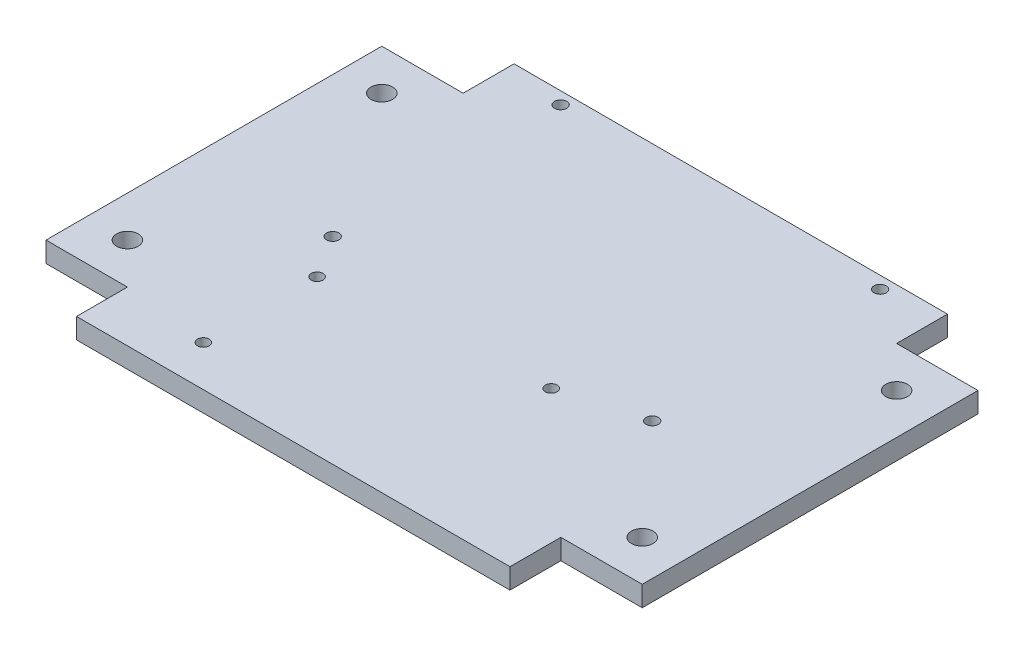
ISO-10303-21;
HEADER;
FILE_DESCRIPTION(('STEP AP214'),'2;1');
FILE_NAME('part.step','',(''),(''),'','','');
FILE_SCHEMA(('AUTOMOTIVE_DESIGN { 1 0 10303 214 1 1 1 1 }'));
ENDSEC;
DATA;
#1=APPLICATION_CONTEXT('core data for automotive mechanical design processes');
#2=APPLICATION_PROTOCOL_DEFINITION('international standard','automotive_design',2000,#1);
#3=PRODUCT_CONTEXT('',#1,'mechanical');
#4=PRODUCT('Part','Part','',(#3));
#5=PRODUCT_RELATED_PRODUCT_CATEGORY('part','',(#4));
#6=PRODUCT_DEFINITION_FORMATION('','',#4);
#7=PRODUCT_DEFINITION_CONTEXT('part definition',#1,'design');
#8=PRODUCT_DEFINITION('design','',#6,#7);
#9=PRODUCT_DEFINITION_SHAPE('','',#8);
#10=(LENGTH_UNIT() NAMED_UNIT(*) SI_UNIT(.MILLI.,.METRE.));
#11=(NAMED_UNIT(*) PLANE_ANGLE_UNIT() SI_UNIT($,.RADIAN.));
#12=(NAMED_UNIT(*) SI_UNIT($,.STERADIAN.) SOLID_ANGLE_UNIT());
#13=UNCERTAINTY_MEASURE_WITH_UNIT(LENGTH_MEASURE(1.E-05),#10,'distance_accuracy_value','');
#14=(GEOMETRIC_REPRESENTATION_CONTEXT(3) GLOBAL_UNCERTAINTY_ASSIGNED_CONTEXT((#13)) GLOBAL_UNIT_ASSIGNED_CONTEXT((#10,
#11,#12)) REPRESENTATION_CONTEXT('',''));
#15=CARTESIAN_POINT('',(0.,0.,0.));
#16=DIRECTION('',(0.,0.,1.));
#17=DIRECTION('',(1.,0.,0.));
#18=AXIS2_PLACEMENT_3D('',#15,#16,#17);
#19=CARTESIAN_POINT('',(53.25,5.,50.));
#20=DIRECTION('',(0.,0.,-1.));
#21=DIRECTION('',(-1.,0.,0.));
#22=AXIS2_PLACEMENT_3D('',#19,#20,#21);
#23=PLANE('',#22);
#24=DIRECTION('',(1.,0.,0.));
#25=VECTOR('',#24,1.);
#26=CARTESIAN_POINT('',(53.25,0.,50.));
#27=LINE('',#26,#25);
#28=CARTESIAN_POINT('',(-53.25,0.,50.));
#29=VERTEX_POINT('',#28);
#30=CARTESIAN_POINT('',(53.25,0.,50.));
#31=VERTEX_POINT('',#30);
#32=EDGE_CURVE('E159',#29,#31,#27,.T.);
#33=ORIENTED_EDGE('',*,*,#32,.T.);
#34=DIRECTION('',(0.,-1.,0.));
#35=VECTOR('',#34,1.);
#36=CARTESIAN_POINT('',(53.25,5.,50.));
#37=LINE('',#36,#35);
#38=CARTESIAN_POINT('',(53.25,5.,50.));
#39=VERTEX_POINT('',#38);
#40=EDGE_CURVE('E11',#39,#31,#37,.T.);
#41=ORIENTED_EDGE('',*,*,#40,.F.);
#42=DIRECTION('',(1.,0.,0.));
#43=VECTOR('',#42,1.);
#44=CARTESIAN_POINT('',(53.25,5.,50.));
#45=LINE('',#44,#43);
#46=CARTESIAN_POINT('',(-53.25,5.,50.));
#47=VERTEX_POINT('',#46);
#48=EDGE_CURVE('E182',#47,#39,#45,.T.);
#49=ORIENTED_EDGE('',*,*,#48,.F.);
#50=DIRECTION('',(0.,-1.,0.));
#51=VECTOR('',#50,1.);
#52=CARTESIAN_POINT('',(-53.25,5.,50.));
#53=LINE('',#52,#51);
#54=EDGE_CURVE('E155',#47,#29,#53,.T.);
#55=ORIENTED_EDGE('',*,*,#54,.T.);
#56=EDGE_LOOP('',(#33,#41,#49,#55));
#57=FACE_BOUND('',#56,.T.);
#58=ADVANCED_FACE('F37',(#57),#23,.F.);
#59=CARTESIAN_POINT('',(53.25,5.,50.));
#60=DIRECTION('',(-1.,0.,0.));
#61=DIRECTION('',(0.,0.,1.));
#62=AXIS2_PLACEMENT_3D('',#59,#60,#61);
#63=PLANE('',#62);
#64=DIRECTION('',(0.,0.,-1.));
#65=VECTOR('',#64,1.);
#66=CARTESIAN_POINT('',(53.25,0.,50.));
#67=LINE('',#66,#65);
#68=CARTESIAN_POINT('',(53.25,0.,37.5));
#69=VERTEX_POINT('',#68);
#70=EDGE_CURVE('E162',#31,#69,#67,.T.);
#71=ORIENTED_EDGE('',*,*,#70,.T.);
#72=DIRECTION('',(0.,-1.,0.));
#73=VECTOR('',#72,1.);
#74=CARTESIAN_POINT('',(53.25,5.,37.5));
#75=LINE('',#74,#73);
#76=CARTESIAN_POINT('',(53.25,5.,37.5));
#77=VERTEX_POINT('',#76);
#78=EDGE_CURVE('E46',#77,#69,#75,.T.);
#79=ORIENTED_EDGE('',*,*,#78,.F.);
#80=DIRECTION('',(0.,0.,-1.));
#81=VECTOR('',#80,1.);
#82=CARTESIAN_POINT('',(53.25,5.,50.));
#83=LINE('',#82,#81);
#84=EDGE_CURVE('E110',#39,#77,#83,.T.);
#85=ORIENTED_EDGE('',*,*,#84,.F.);
#86=ORIENTED_EDGE('',*,*,#40,.T.);
#87=EDGE_LOOP('',(#71,#79,#85,#86));
#88=FACE_BOUND('',#87,.T.);
#89=ADVANCED_FACE('F298',(#88),#63,.F.);
#90=CARTESIAN_POINT('',(53.25,5.,37.5));
#91=DIRECTION('',(0.,0.,-1.));
#92=DIRECTION('',(-1.,0.,0.));
#93=AXIS2_PLACEMENT_3D('',#90,#91,#92);
#94=PLANE('',#93);
#95=DIRECTION('',(1.,0.,0.));
#96=VECTOR('',#95,1.);
#97=CARTESIAN_POINT('',(53.25,0.,37.5));
#98=LINE('',#97,#96);
#99=CARTESIAN_POINT('',(73.25,0.,37.5));
#100=VERTEX_POINT('',#99);
#101=EDGE_CURVE('E165',#69,#100,#98,.T.);
#102=ORIENTED_EDGE('',*,*,#101,.T.);
#103=DIRECTION('',(0.,-1.,0.));
#104=VECTOR('',#103,1.);
#105=CARTESIAN_POINT('',(73.25,5.,37.5));
#106=LINE('',#105,#104);
#107=CARTESIAN_POINT('',(73.25,5.,37.5));
#108=VERTEX_POINT('',#107);
#109=EDGE_CURVE('E201',#108,#100,#106,.T.);
#110=ORIENTED_EDGE('',*,*,#109,.F.);
#111=DIRECTION('',(1.,0.,0.));
#112=VECTOR('',#111,1.);
#113=CARTESIAN_POINT('',(53.25,5.,37.5));
#114=LINE('',#113,#112);
#115=EDGE_CURVE('E257',#77,#108,#114,.T.);
#116=ORIENTED_EDGE('',*,*,#115,.F.);
#117=ORIENTED_EDGE('',*,*,#78,.T.);
#118=EDGE_LOOP('',(#102,#110,#116,#117));
#119=FACE_BOUND('',#118,.T.);
#120=ADVANCED_FACE('F302',(#119),#94,.F.);
#121=CARTESIAN_POINT('',(73.2499999999997,5.,-45.));
#122=DIRECTION('',(-1.,0.,0.));
#123=DIRECTION('',(0.,0.,1.));
#124=AXIS2_PLACEMENT_3D('',#121,#122,#123);
#125=PLANE('',#124);
#126=DIRECTION('',(0.,0.,-1.));
#127=VECTOR('',#126,1.);
#128=CARTESIAN_POINT('',(73.2499999999997,0.,-45.));
#129=LINE('',#128,#127);
#130=CARTESIAN_POINT('',(73.2499999999997,0.,-45.));
#131=VERTEX_POINT('',#130);
#132=EDGE_CURVE('E167',#100,#131,#129,.T.);
#133=ORIENTED_EDGE('',*,*,#132,.T.);
#134=DIRECTION('',(0.,-1.,0.));
#135=VECTOR('',#134,1.);
#136=CARTESIAN_POINT('',(73.2499999999997,5.,-45.));
#137=LINE('',#136,#135);
#138=CARTESIAN_POINT('',(73.2499999999997,5.,-45.));
#139=VERTEX_POINT('',#138);
#140=EDGE_CURVE('E198',#139,#131,#137,.T.);
#141=ORIENTED_EDGE('',*,*,#140,.F.);
#142=DIRECTION('',(0.,0.,-1.));
#143=VECTOR('',#142,1.);
#144=CARTESIAN_POINT('',(73.2499999999997,5.,-45.));
#145=LINE('',#144,#143);
#146=EDGE_CURVE('E259',#108,#139,#145,.T.);
#147=ORIENTED_EDGE('',*,*,#146,.F.);
#148=ORIENTED_EDGE('',*,*,#109,.T.);
#149=EDGE_LOOP('',(#133,#141,#147,#148));
#150=FACE_BOUND('',#149,.T.);
#151=ADVANCED_FACE('F306',(#150),#125,.F.);
#152=CARTESIAN_POINT('',(53.25,5.,-45.));
#153=DIRECTION('',(0.,0.,1.));
#154=DIRECTION('',(1.,0.,0.));
#155=AXIS2_PLACEMENT_3D('',#152,#153,#154);
#156=PLANE('',#155);
#157=DIRECTION('',(-1.,0.,0.));
#158=VECTOR('',#157,1.);
#159=CARTESIAN_POINT('',(53.25,0.,-45.));
#160=LINE('',#159,#158);
#161=CARTESIAN_POINT('',(53.25,0.,-45.));
#162=VERTEX_POINT('',#161);
#163=EDGE_CURVE('E169',#131,#162,#160,.T.);
#164=ORIENTED_EDGE('',*,*,#163,.T.);
#165=DIRECTION('',(0.,-1.,0.));
#166=VECTOR('',#165,1.);
#167=CARTESIAN_POINT('',(53.25,5.,-45.));
#168=LINE('',#167,#166);
#169=CARTESIAN_POINT('',(53.25,5.,-45.));
#170=VERTEX_POINT('',#169);
#171=EDGE_CURVE('E195',#170,#162,#168,.T.);
#172=ORIENTED_EDGE('',*,*,#171,.F.);
#173=DIRECTION('',(-1.,0.,0.));
#174=VECTOR('',#173,1.);
#175=CARTESIAN_POINT('',(53.25,5.,-45.));
#176=LINE('',#175,#174);
#177=EDGE_CURVE('E261',#139,#170,#176,.T.);
#178=ORIENTED_EDGE('',*,*,#177,.F.);
#179=ORIENTED_EDGE('',*,*,#140,.T.);
#180=EDGE_LOOP('',(#164,#172,#178,#179));
#181=FACE_BOUND('',#180,.T.);
#182=ADVANCED_FACE('F312',(#181),#156,.F.);
#183=CARTESIAN_POINT('',(53.25,5.,-45.));
#184=DIRECTION('',(-1.,0.,0.));
#185=DIRECTION('',(0.,0.,1.));
#186=AXIS2_PLACEMENT_3D('',#183,#184,#185);
#187=PLANE('',#186);
#188=DIRECTION('',(0.,0.,-1.));
#189=VECTOR('',#188,1.);
#190=CARTESIAN_POINT('',(53.25,0.,-45.));
#191=LINE('',#190,#189);
#192=CARTESIAN_POINT('',(53.2499999999997,0.,-57.5));
#193=VERTEX_POINT('',#192);
#194=EDGE_CURVE('E171',#162,#193,#191,.T.);
#195=ORIENTED_EDGE('',*,*,#194,.T.);
#196=DIRECTION('',(0.,-1.,0.));
#197=VECTOR('',#196,1.);
#198=CARTESIAN_POINT('',(53.2499999999997,5.,-57.5));
#199=LINE('',#198,#197);
#200=CARTESIAN_POINT('',(53.2499999999997,5.,-57.5));
#201=VERTEX_POINT('',#200);
#202=EDGE_CURVE('E192',#201,#193,#199,.T.);
#203=ORIENTED_EDGE('',*,*,#202,.F.);
#204=DIRECTION('',(0.,0.,-1.));
#205=VECTOR('',#204,1.);
#206=CARTESIAN_POINT('',(53.25,5.,-45.));
#207=LINE('',#206,#205);
#208=EDGE_CURVE('E263',#170,#201,#207,.T.);
#209=ORIENTED_EDGE('',*,*,#208,.F.);
#210=ORIENTED_EDGE('',*,*,#171,.T.);
#211=EDGE_LOOP('',(#195,#203,#209,#210));
#212=FACE_BOUND('',#211,.T.);
#213=ADVANCED_FACE('F316',(#212),#187,.F.);
#214=CARTESIAN_POINT('',(-53.2500000000003,5.,-57.5));
#215=DIRECTION('',(0.,0.,1.));
#216=DIRECTION('',(1.,0.,0.));
#217=AXIS2_PLACEMENT_3D('',#214,#215,#216);
#218=PLANE('',#217);
#219=DIRECTION('',(-1.,0.,0.));
#220=VECTOR('',#219,1.);
#221=CARTESIAN_POINT('',(-53.2500000000003,0.,-57.5));
#222=LINE('',#221,#220);
#223=CARTESIAN_POINT('',(-53.2500000000003,0.,-57.5));
#224=VERTEX_POINT('',#223);
#225=EDGE_CURVE('E173',#193,#224,#222,.T.);
#226=ORIENTED_EDGE('',*,*,#225,.T.);
#227=DIRECTION('',(0.,-1.,0.));
#228=VECTOR('',#227,1.);
#229=CARTESIAN_POINT('',(-53.2500000000003,5.,-57.5));
#230=LINE('',#229,#228);
#231=CARTESIAN_POINT('',(-53.2500000000003,5.,-57.5));
#232=VERTEX_POINT('',#231);
#233=EDGE_CURVE('E189',#232,#224,#230,.T.);
#234=ORIENTED_EDGE('',*,*,#233,.F.);
#235=DIRECTION('',(-1.,0.,0.));
#236=VECTOR('',#235,1.);
#237=CARTESIAN_POINT('',(-53.2500000000003,5.,-57.5));
#238=LINE('',#237,#236);
#239=EDGE_CURVE('E265',#201,#232,#238,.T.);
#240=ORIENTED_EDGE('',*,*,#239,.F.);
#241=ORIENTED_EDGE('',*,*,#202,.T.);
#242=EDGE_LOOP('',(#226,#234,#240,#241));
#243=FACE_BOUND('',#242,.T.);
#244=ADVANCED_FACE('F320',(#243),#218,.F.);
#245=CARTESIAN_POINT('',(-53.2500000000003,5.,-45.));
#246=DIRECTION('',(1.,0.,0.));
#247=DIRECTION('',(0.,0.,-1.));
#248=AXIS2_PLACEMENT_3D('',#245,#246,#247);
#249=PLANE('',#248);
#250=DIRECTION('',(0.,0.,1.));
#251=VECTOR('',#250,1.);
#252=CARTESIAN_POINT('',(-53.2500000000003,0.,-45.));
#253=LINE('',#252,#251);
#254=CARTESIAN_POINT('',(-53.2500000000003,0.,-45.));
#255=VERTEX_POINT('',#254);
#256=EDGE_CURVE('E175',#224,#255,#253,.T.);
#257=ORIENTED_EDGE('',*,*,#256,.T.);
#258=DIRECTION('',(0.,-1.,0.));
#259=VECTOR('',#258,1.);
#260=CARTESIAN_POINT('',(-53.2500000000003,5.,-45.));
#261=LINE('',#260,#259);
#262=CARTESIAN_POINT('',(-53.2500000000003,5.,-45.));
#263=VERTEX_POINT('',#262);
#264=EDGE_CURVE('E186',#263,#255,#261,.T.);
#265=ORIENTED_EDGE('',*,*,#264,.F.);
#266=DIRECTION('',(0.,0.,1.));
#267=VECTOR('',#266,1.);
#268=CARTESIAN_POINT('',(-53.2500000000003,5.,-45.));
#269=LINE('',#268,#267);
#270=EDGE_CURVE('E267',#232,#263,#269,.T.);
#271=ORIENTED_EDGE('',*,*,#270,.F.);
#272=ORIENTED_EDGE('',*,*,#233,.T.);
#273=EDGE_LOOP('',(#257,#265,#271,#272));
#274=FACE_BOUND('',#273,.T.);
#275=ADVANCED_FACE('F273',(#274),#249,.F.);
#276=CARTESIAN_POINT('',(-73.25,5.,-45.));
#277=DIRECTION('',(0.,0.,1.));
#278=DIRECTION('',(1.,0.,0.));
#279=AXIS2_PLACEMENT_3D('',#276,#277,#278);
#280=PLANE('',#279);
#281=DIRECTION('',(-1.,0.,0.));
#282=VECTOR('',#281,1.);
#283=CARTESIAN_POINT('',(-73.25,0.,-45.));
#284=LINE('',#283,#282);
#285=CARTESIAN_POINT('',(-73.25,0.,-45.));
#286=VERTEX_POINT('',#285);
#287=EDGE_CURVE('E177',#255,#286,#284,.T.);
#288=ORIENTED_EDGE('',*,*,#287,.T.);
#289=DIRECTION('',(0.,-1.,0.));
#290=VECTOR('',#289,1.);
#291=CARTESIAN_POINT('',(-73.25,5.,-45.));
#292=LINE('',#291,#290);
#293=CARTESIAN_POINT('',(-73.25,5.,-45.));
#294=VERTEX_POINT('',#293);
#295=EDGE_CURVE('E150',#294,#286,#292,.T.);
#296=ORIENTED_EDGE('',*,*,#295,.F.);
#297=DIRECTION('',(-1.,0.,0.));
#298=VECTOR('',#297,1.);
#299=CARTESIAN_POINT('',(-73.25,5.,-45.));
#300=LINE('',#299,#298);
#301=EDGE_CURVE('E141',#263,#294,#300,.T.);
#302=ORIENTED_EDGE('',*,*,#301,.F.);
#303=ORIENTED_EDGE('',*,*,#264,.T.);
#304=EDGE_LOOP('',(#288,#296,#302,#303));
#305=FACE_BOUND('',#304,.T.);
#306=ADVANCED_FACE('F277',(#305),#280,.F.);
#307=CARTESIAN_POINT('',(-73.25,5.,37.5));
#308=DIRECTION('',(1.,0.,0.));
#309=DIRECTION('',(0.,0.,-1.));
#310=AXIS2_PLACEMENT_3D('',#307,#308,#309);
#311=PLANE('',#310);
#312=DIRECTION('',(0.,0.,1.));
#313=VECTOR('',#312,1.);
#314=CARTESIAN_POINT('',(-73.25,0.,37.5));
#315=LINE('',#314,#313);
#316=CARTESIAN_POINT('',(-73.25,0.,37.5));
#317=VERTEX_POINT('',#316);
#318=EDGE_CURVE('E149',#286,#317,#315,.T.);
#319=ORIENTED_EDGE('',*,*,#318,.T.);
#320=DIRECTION('',(0.,-1.,0.));
#321=VECTOR('',#320,1.);
#322=CARTESIAN_POINT('',(-73.25,5.,37.5));
#323=LINE('',#322,#321);
#324=CARTESIAN_POINT('',(-73.25,5.,37.5));
#325=VERTEX_POINT('',#324);
#326=EDGE_CURVE('E146',#325,#317,#323,.T.);
#327=ORIENTED_EDGE('',*,*,#326,.F.);
#328=DIRECTION('',(0.,0.,1.));
#329=VECTOR('',#328,1.);
#330=CARTESIAN_POINT('',(-73.25,5.,37.5));
#331=LINE('',#330,#329);
#332=EDGE_CURVE('E135',#294,#325,#331,.T.);
#333=ORIENTED_EDGE('',*,*,#332,.F.);
#334=ORIENTED_EDGE('',*,*,#295,.T.);
#335=EDGE_LOOP('',(#319,#327,#333,#334));
#336=FACE_BOUND('',#335,.T.);
#337=ADVANCED_FACE('F147',(#336),#311,.F.);
#338=CARTESIAN_POINT('',(-73.25,5.,37.5));
#339=DIRECTION('',(0.,0.,-1.));
#340=DIRECTION('',(-1.,0.,0.));
#341=AXIS2_PLACEMENT_3D('',#338,#339,#340);
#342=PLANE('',#341);
#343=DIRECTION('',(1.,0.,0.));
#344=VECTOR('',#343,1.);
#345=CARTESIAN_POINT('',(-73.25,0.,37.5));
#346=LINE('',#345,#344);
#347=CARTESIAN_POINT('',(-53.25,0.,37.5));
#348=VERTEX_POINT('',#347);
#349=EDGE_CURVE('E96',#317,#348,#346,.T.);
#350=ORIENTED_EDGE('',*,*,#349,.T.);
#351=DIRECTION('',(0.,-1.,0.));
#352=VECTOR('',#351,1.);
#353=CARTESIAN_POINT('',(-53.25,5.,37.5));
#354=LINE('',#353,#352);
#355=CARTESIAN_POINT('',(-53.25,5.,37.5));
#356=VERTEX_POINT('',#355);
#357=EDGE_CURVE('E151',#356,#348,#354,.T.);
#358=ORIENTED_EDGE('',*,*,#357,.F.);
#359=DIRECTION('',(1.,0.,0.));
#360=VECTOR('',#359,1.);
#361=CARTESIAN_POINT('',(-73.25,5.,37.5));
#362=LINE('',#361,#360);
#363=EDGE_CURVE('E139',#325,#356,#362,.T.);
#364=ORIENTED_EDGE('',*,*,#363,.F.);
#365=ORIENTED_EDGE('',*,*,#326,.T.);
#366=EDGE_LOOP('',(#350,#358,#364,#365));
#367=FACE_BOUND('',#366,.T.);
#368=ADVANCED_FACE('F153',(#367),#342,.F.);
#369=CARTESIAN_POINT('',(-53.25,5.,50.));
#370=DIRECTION('',(1.,0.,0.));
#371=DIRECTION('',(0.,0.,-1.));
#372=AXIS2_PLACEMENT_3D('',#369,#370,#371);
#373=PLANE('',#372);
#374=DIRECTION('',(0.,0.,1.));
#375=VECTOR('',#374,1.);
#376=CARTESIAN_POINT('',(-53.25,0.,50.));
#377=LINE('',#376,#375);
#378=EDGE_CURVE('E102',#348,#29,#377,.T.);
#379=ORIENTED_EDGE('',*,*,#378,.T.);
#380=ORIENTED_EDGE('',*,*,#54,.F.);
#381=DIRECTION('',(0.,0.,1.));
#382=VECTOR('',#381,1.);
#383=CARTESIAN_POINT('',(-53.25,5.,50.));
#384=LINE('',#383,#382);
#385=EDGE_CURVE('E55',#356,#47,#384,.T.);
#386=ORIENTED_EDGE('',*,*,#385,.F.);
#387=ORIENTED_EDGE('',*,*,#357,.T.);
#388=EDGE_LOOP('',(#379,#380,#386,#387));
#389=FACE_BOUND('',#388,.T.);
#390=ADVANCED_FACE('F285',(#389),#373,.F.);
#391=CARTESIAN_POINT('',(0.,5.,0.));
#392=DIRECTION('',(0.,-1.,0.));
#393=DIRECTION('',(0.,0.,-1.));
#394=AXIS2_PLACEMENT_3D('',#391,#392,#393);
#395=PLANE('',#394);
#396=CARTESIAN_POINT('',(-32.1318726234697,5.,39.96));
#397=DIRECTION('',(0.,1.,0.));
#398=DIRECTION('',(0.,0.,1.));
#399=AXIS2_PLACEMENT_3D('',#396,#397,#398);
#400=CIRCLE('',#399,1.445);
#401=CARTESIAN_POINT('',(-32.1318726234697,5.,41.405));
#402=VERTEX_POINT('',#401);
#403=EDGE_CURVE('E570',#402,#402,#400,.T.);
#404=ORIENTED_EDGE('',*,*,#403,.F.);
#405=EDGE_LOOP('',(#404));
#406=FACE_BOUND('',#405,.T.);
#407=CARTESIAN_POINT('',(39.7023107365525,5.,1.49999999999998));
#408=DIRECTION('',(0.,1.,0.));
#409=DIRECTION('',(0.,0.,1.));
#410=AXIS2_PLACEMENT_3D('',#407,#408,#409);
#411=CIRCLE('',#410,1.5);
#412=CARTESIAN_POINT('',(39.7023107365525,5.,2.99999999999999));
#413=VERTEX_POINT('',#412);
#414=EDGE_CURVE('E571',#413,#413,#411,.T.);
#415=ORIENTED_EDGE('',*,*,#414,.F.);
#416=EDGE_LOOP('',(#415));
#417=FACE_BOUND('',#416,.T.);
#418=CARTESIAN_POINT('',(-38.7976892634475,5.,1.49999999999998));
#419=DIRECTION('',(0.,1.,0.));
#420=DIRECTION('',(0.,0.,1.));
#421=AXIS2_PLACEMENT_3D('',#418,#419,#420);
#422=CIRCLE('',#421,1.5);
#423=CARTESIAN_POINT('',(-38.7976892634475,5.,2.99999999999999));
#424=VERTEX_POINT('',#423);
#425=EDGE_CURVE('E575',#424,#424,#422,.T.);
#426=ORIENTED_EDGE('',*,*,#425,.F.);
#427=EDGE_LOOP('',(#426));
#428=FACE_BOUND('',#427,.T.);
#429=CARTESIAN_POINT('',(39.7023107365525,5.,-54.5));
#430=DIRECTION('',(0.,1.,0.));
#431=DIRECTION('',(0.,0.,1.));
#432=AXIS2_PLACEMENT_3D('',#429,#430,#431);
#433=CIRCLE('',#432,1.5);
#434=CARTESIAN_POINT('',(39.7023107365525,5.,-53.));
#435=VERTEX_POINT('',#434);
#436=EDGE_CURVE('E582',#435,#435,#433,.T.);
#437=ORIENTED_EDGE('',*,*,#436,.F.);
#438=EDGE_LOOP('',(#437));
#439=FACE_BOUND('',#438,.T.);
#440=CARTESIAN_POINT('',(-32.1318726234696,5.,12.));
#441=DIRECTION('',(0.,1.,0.));
#442=DIRECTION('',(0.,0.,1.));
#443=AXIS2_PLACEMENT_3D('',#440,#441,#442);
#444=CIRCLE('',#443,1.445);
#445=CARTESIAN_POINT('',(-32.1318726234696,5.,13.445));
#446=VERTEX_POINT('',#445);
#447=EDGE_CURVE('E572',#446,#446,#444,.T.);
#448=ORIENTED_EDGE('',*,*,#447,.F.);
#449=EDGE_LOOP('',(#448));
#450=FACE_BOUND('',#449,.T.);
#451=CARTESIAN_POINT('',(20.3881273765304,5.,7.00000000000001));
#452=DIRECTION('',(0.,1.,0.));
#453=DIRECTION('',(0.,0.,1.));
#454=AXIS2_PLACEMENT_3D('',#451,#452,#453);
#455=CIRCLE('',#454,1.445);
#456=CARTESIAN_POINT('',(20.3881273765304,5.,8.44500000000001));
#457=VERTEX_POINT('',#456);
#458=EDGE_CURVE('E578',#457,#457,#455,.T.);
#459=ORIENTED_EDGE('',*,*,#458,.F.);
#460=EDGE_LOOP('',(#459));
#461=FACE_BOUND('',#460,.T.);
#462=CARTESIAN_POINT('',(-38.7976892634475,5.,-54.5));
#463=DIRECTION('',(0.,1.,0.));
#464=DIRECTION('',(0.,0.,1.));
#465=AXIS2_PLACEMENT_3D('',#462,#463,#464);
#466=CIRCLE('',#465,1.5);
#467=CARTESIAN_POINT('',(-38.7976892634475,5.,-53.));
#468=VERTEX_POINT('',#467);
#469=EDGE_CURVE('E210',#468,#468,#466,.T.);
#470=ORIENTED_EDGE('',*,*,#469,.F.);
#471=EDGE_LOOP('',(#470));
#472=FACE_BOUND('',#471,.T.);
#473=CARTESIAN_POINT('',(-63.25,5.,27.5));
#474=DIRECTION('',(0.,1.,0.));
#475=DIRECTION('',(0.,0.,1.));
#476=AXIS2_PLACEMENT_3D('',#473,#474,#475);
#477=CIRCLE('',#476,2.65);
#478=CARTESIAN_POINT('',(-63.25,5.,30.15));
#479=VERTEX_POINT('',#478);
#480=EDGE_CURVE('E239',#479,#479,#477,.T.);
#481=ORIENTED_EDGE('',*,*,#480,.F.);
#482=EDGE_LOOP('',(#481));
#483=FACE_BOUND('',#482,.T.);
#484=CARTESIAN_POINT('',(63.25,5.,-35.));
#485=DIRECTION('',(0.,1.,0.));
#486=DIRECTION('',(0.,0.,1.));
#487=AXIS2_PLACEMENT_3D('',#484,#485,#486);
#488=CIRCLE('',#487,2.65);
#489=CARTESIAN_POINT('',(63.25,5.,-32.35));
#490=VERTEX_POINT('',#489);
#491=EDGE_CURVE('E246',#490,#490,#488,.T.);
#492=ORIENTED_EDGE('',*,*,#491,.F.);
#493=EDGE_LOOP('',(#492));
#494=FACE_BOUND('',#493,.T.);
#495=CARTESIAN_POINT('',(63.25,5.,27.5));
#496=DIRECTION('',(0.,1.,0.));
#497=DIRECTION('',(0.,0.,1.));
#498=AXIS2_PLACEMENT_3D('',#495,#496,#497);
#499=CIRCLE('',#498,2.65);
#500=CARTESIAN_POINT('',(63.25,5.,30.15));
#501=VERTEX_POINT('',#500);
#502=EDGE_CURVE('E230',#501,#501,#499,.T.);
#503=ORIENTED_EDGE('',*,*,#502,.F.);
#504=EDGE_LOOP('',(#503));
#505=FACE_BOUND('',#504,.T.);
#506=CARTESIAN_POINT('',(-63.25,5.,-35.));
#507=DIRECTION('',(0.,1.,0.));
#508=DIRECTION('',(0.,0.,1.));
#509=AXIS2_PLACEMENT_3D('',#506,#507,#508);
#510=CIRCLE('',#509,2.65);
#511=CARTESIAN_POINT('',(-63.25,5.,-32.35));
#512=VERTEX_POINT('',#511);
#513=EDGE_CURVE('E242',#512,#512,#510,.T.);
#514=ORIENTED_EDGE('',*,*,#513,.F.);
#515=EDGE_LOOP('',(#514));
#516=FACE_BOUND('',#515,.T.);
#517=ORIENTED_EDGE('',*,*,#48,.T.);
#518=ORIENTED_EDGE('',*,*,#84,.T.);
#519=ORIENTED_EDGE('',*,*,#115,.T.);
#520=ORIENTED_EDGE('',*,*,#146,.T.);
#521=ORIENTED_EDGE('',*,*,#177,.T.);
#522=ORIENTED_EDGE('',*,*,#208,.T.);
#523=ORIENTED_EDGE('',*,*,#239,.T.);
#524=ORIENTED_EDGE('',*,*,#270,.T.);
#525=ORIENTED_EDGE('',*,*,#301,.T.);
#526=ORIENTED_EDGE('',*,*,#332,.T.);
#527=ORIENTED_EDGE('',*,*,#363,.T.);
#528=ORIENTED_EDGE('',*,*,#385,.T.);
#529=EDGE_LOOP('',(#517,#518,#519,#520,#521,#522,#523,#524,#525,#526,#527,#528));
#530=FACE_BOUND('',#529,.T.);
#531=ADVANCED_FACE('F137',(#406,#417,#428,#439,#450,#461,#472,#483,#494,#505,#516,#530),#395,.F.);
#532=CARTESIAN_POINT('',(0.,0.,0.));
#533=DIRECTION('',(0.,-1.,0.));
#534=DIRECTION('',(0.,0.,-1.));
#535=AXIS2_PLACEMENT_3D('',#532,#533,#534);
#536=PLANE('',#535);
#537=CARTESIAN_POINT('',(-32.1318726234697,0.,39.96));
#538=DIRECTION('',(0.,-1.,0.));
#539=DIRECTION('',(0.,0.,-1.));
#540=AXIS2_PLACEMENT_3D('',#537,#538,#539);
#541=CIRCLE('',#540,1.445);
#542=CARTESIAN_POINT('',(-32.1318726234697,0.,38.515));
#543=VERTEX_POINT('',#542);
#544=EDGE_CURVE('E40',#543,#543,#541,.T.);
#545=ORIENTED_EDGE('',*,*,#544,.F.);
#546=EDGE_LOOP('',(#545));
#547=FACE_BOUND('',#546,.T.);
#548=CARTESIAN_POINT('',(39.7023107365525,0.,1.49999999999998));
#549=DIRECTION('',(0.,-1.,0.));
#550=DIRECTION('',(0.,0.,-1.));
#551=AXIS2_PLACEMENT_3D('',#548,#549,#550);
#552=CIRCLE('',#551,1.5);
#553=CARTESIAN_POINT('',(39.7023107365525,0.,0.));
#554=VERTEX_POINT('',#553);
#555=EDGE_CURVE('E221',#554,#554,#552,.T.);
#556=ORIENTED_EDGE('',*,*,#555,.F.);
#557=EDGE_LOOP('',(#556));
#558=FACE_BOUND('',#557,.T.);
#559=CARTESIAN_POINT('',(-38.7976892634475,0.,1.49999999999998));
#560=DIRECTION('',(0.,-1.,0.));
#561=DIRECTION('',(0.,0.,-1.));
#562=AXIS2_PLACEMENT_3D('',#559,#560,#561);
#563=CIRCLE('',#562,1.5);
#564=CARTESIAN_POINT('',(-38.7976892634475,0.,0.));
#565=VERTEX_POINT('',#564);
#566=EDGE_CURVE('E219',#565,#565,#563,.T.);
#567=ORIENTED_EDGE('',*,*,#566,.F.);
#568=EDGE_LOOP('',(#567));
#569=FACE_BOUND('',#568,.T.);
#570=CARTESIAN_POINT('',(39.7023107365525,0.,-54.5));
#571=DIRECTION('',(0.,-1.,0.));
#572=DIRECTION('',(0.,0.,-1.));
#573=AXIS2_PLACEMENT_3D('',#570,#571,#572);
#574=CIRCLE('',#573,1.5);
#575=CARTESIAN_POINT('',(39.7023107365525,0.,-56.));
#576=VERTEX_POINT('',#575);
#577=EDGE_CURVE('E216',#576,#576,#574,.T.);
#578=ORIENTED_EDGE('',*,*,#577,.F.);
#579=EDGE_LOOP('',(#578));
#580=FACE_BOUND('',#579,.T.);
#581=CARTESIAN_POINT('',(-32.1318726234696,0.,12.));
#582=DIRECTION('',(0.,-1.,0.));
#583=DIRECTION('',(0.,0.,-1.));
#584=AXIS2_PLACEMENT_3D('',#581,#582,#583);
#585=CIRCLE('',#584,1.445);
#586=CARTESIAN_POINT('',(-32.1318726234696,0.,10.555));
#587=VERTEX_POINT('',#586);
#588=EDGE_CURVE('E213',#587,#587,#585,.T.);
#589=ORIENTED_EDGE('',*,*,#588,.F.);
#590=EDGE_LOOP('',(#589));
#591=FACE_BOUND('',#590,.T.);
#592=CARTESIAN_POINT('',(20.3881273765304,0.,7.00000000000001));
#593=DIRECTION('',(0.,-1.,0.));
#594=DIRECTION('',(0.,0.,-1.));
#595=AXIS2_PLACEMENT_3D('',#592,#593,#594);
#596=CIRCLE('',#595,1.445);
#597=CARTESIAN_POINT('',(20.3881273765304,0.,5.55500000000001));
#598=VERTEX_POINT('',#597);
#599=EDGE_CURVE('E209',#598,#598,#596,.T.);
#600=ORIENTED_EDGE('',*,*,#599,.F.);
#601=EDGE_LOOP('',(#600));
#602=FACE_BOUND('',#601,.T.);
#603=CARTESIAN_POINT('',(-38.7976892634475,0.,-54.5));
#604=DIRECTION('',(0.,-1.,0.));
#605=DIRECTION('',(0.,0.,-1.));
#606=AXIS2_PLACEMENT_3D('',#603,#604,#605);
#607=CIRCLE('',#606,1.5);
#608=CARTESIAN_POINT('',(-38.7976892634475,0.,-56.));
#609=VERTEX_POINT('',#608);
#610=EDGE_CURVE('E206',#609,#609,#607,.T.);
#611=ORIENTED_EDGE('',*,*,#610,.F.);
#612=EDGE_LOOP('',(#611));
#613=FACE_BOUND('',#612,.T.);
#614=CARTESIAN_POINT('',(-63.25,0.,27.5));
#615=DIRECTION('',(0.,1.,0.));
#616=DIRECTION('',(0.,0.,1.));
#617=AXIS2_PLACEMENT_3D('',#614,#615,#616);
#618=CIRCLE('',#617,2.65);
#619=CARTESIAN_POINT('',(-63.25,0.,30.15));
#620=VERTEX_POINT('',#619);
#621=EDGE_CURVE('E243',#620,#620,#618,.T.);
#622=ORIENTED_EDGE('',*,*,#621,.T.);
#623=EDGE_LOOP('',(#622));
#624=FACE_BOUND('',#623,.T.);
#625=CARTESIAN_POINT('',(63.25,0.,-35.));
#626=DIRECTION('',(0.,1.,0.));
#627=DIRECTION('',(0.,0.,1.));
#628=AXIS2_PLACEMENT_3D('',#625,#626,#627);
#629=CIRCLE('',#628,2.65);
#630=CARTESIAN_POINT('',(63.25,0.,-32.35));
#631=VERTEX_POINT('',#630);
#632=EDGE_CURVE('E235',#631,#631,#629,.T.);
#633=ORIENTED_EDGE('',*,*,#632,.T.);
#634=EDGE_LOOP('',(#633));
#635=FACE_BOUND('',#634,.T.);
#636=CARTESIAN_POINT('',(63.25,0.,27.5));
#637=DIRECTION('',(0.,1.,0.));
#638=DIRECTION('',(0.,0.,1.));
#639=AXIS2_PLACEMENT_3D('',#636,#637,#638);
#640=CIRCLE('',#639,2.65);
#641=CARTESIAN_POINT('',(63.25,0.,30.15));
#642=VERTEX_POINT('',#641);
#643=EDGE_CURVE('E226',#642,#642,#640,.T.);
#644=ORIENTED_EDGE('',*,*,#643,.T.);
#645=EDGE_LOOP('',(#644));
#646=FACE_BOUND('',#645,.T.);
#647=CARTESIAN_POINT('',(-63.25,0.,-35.));
#648=DIRECTION('',(0.,1.,0.));
#649=DIRECTION('',(0.,0.,1.));
#650=AXIS2_PLACEMENT_3D('',#647,#648,#649);
#651=CIRCLE('',#650,2.65);
#652=CARTESIAN_POINT('',(-63.25,0.,-32.35));
#653=VERTEX_POINT('',#652);
#654=EDGE_CURVE('E163',#653,#653,#651,.T.);
#655=ORIENTED_EDGE('',*,*,#654,.T.);
#656=EDGE_LOOP('',(#655));
#657=FACE_BOUND('',#656,.T.);
#658=ORIENTED_EDGE('',*,*,#32,.F.);
#659=ORIENTED_EDGE('',*,*,#378,.F.);
#660=ORIENTED_EDGE('',*,*,#349,.F.);
#661=ORIENTED_EDGE('',*,*,#318,.F.);
#662=ORIENTED_EDGE('',*,*,#287,.F.);
#663=ORIENTED_EDGE('',*,*,#256,.F.);
#664=ORIENTED_EDGE('',*,*,#225,.F.);
#665=ORIENTED_EDGE('',*,*,#194,.F.);
#666=ORIENTED_EDGE('',*,*,#163,.F.);
#667=ORIENTED_EDGE('',*,*,#132,.F.);
#668=ORIENTED_EDGE('',*,*,#101,.F.);
#669=ORIENTED_EDGE('',*,*,#70,.F.);
#670=EDGE_LOOP('',(#658,#659,#660,#661,#662,#663,#664,#665,#666,#667,#668,#669));
#671=FACE_BOUND('',#670,.T.);
#672=ADVANCED_FACE('F280',(#547,#558,#569,#580,#591,#602,#613,#624,#635,#646,#657,#671),#536,.T.);
#673=CARTESIAN_POINT('',(-63.25,0.,-35.));
#674=DIRECTION('',(0.,1.,0.));
#675=DIRECTION('',(0.,0.,1.));
#676=AXIS2_PLACEMENT_3D('',#673,#674,#675);
#677=CYLINDRICAL_SURFACE('',#676,2.65);
#678=ORIENTED_EDGE('',*,*,#654,.F.);
#679=EDGE_LOOP('',(#678));
#680=FACE_BOUND('',#679,.T.);
#681=ORIENTED_EDGE('',*,*,#513,.T.);
#682=EDGE_LOOP('',(#681));
#683=FACE_BOUND('',#682,.T.);
#684=ADVANCED_FACE('F350',(#680,#683),#677,.F.);
#685=CARTESIAN_POINT('',(63.25,0.,27.5));
#686=DIRECTION('',(0.,1.,0.));
#687=DIRECTION('',(0.,0.,1.));
#688=AXIS2_PLACEMENT_3D('',#685,#686,#687);
#689=CYLINDRICAL_SURFACE('',#688,2.65);
#690=ORIENTED_EDGE('',*,*,#643,.F.);
#691=EDGE_LOOP('',(#690));
#692=FACE_BOUND('',#691,.T.);
#693=ORIENTED_EDGE('',*,*,#502,.T.);
#694=EDGE_LOOP('',(#693));
#695=FACE_BOUND('',#694,.T.);
#696=ADVANCED_FACE('F355',(#692,#695),#689,.F.);
#697=CARTESIAN_POINT('',(63.25,0.,-35.));
#698=DIRECTION('',(0.,1.,0.));
#699=DIRECTION('',(0.,0.,1.));
#700=AXIS2_PLACEMENT_3D('',#697,#698,#699);
#701=CYLINDRICAL_SURFACE('',#700,2.65);
#702=ORIENTED_EDGE('',*,*,#632,.F.);
#703=EDGE_LOOP('',(#702));
#704=FACE_BOUND('',#703,.T.);
#705=ORIENTED_EDGE('',*,*,#491,.T.);
#706=EDGE_LOOP('',(#705));
#707=FACE_BOUND('',#706,.T.);
#708=ADVANCED_FACE('F368',(#704,#707),#701,.F.);
#709=CARTESIAN_POINT('',(-63.25,0.,27.5));
#710=DIRECTION('',(0.,1.,0.));
#711=DIRECTION('',(0.,0.,1.));
#712=AXIS2_PLACEMENT_3D('',#709,#710,#711);
#713=CYLINDRICAL_SURFACE('',#712,2.65);
#714=ORIENTED_EDGE('',*,*,#621,.F.);
#715=EDGE_LOOP('',(#714));
#716=FACE_BOUND('',#715,.T.);
#717=ORIENTED_EDGE('',*,*,#480,.T.);
#718=EDGE_LOOP('',(#717));
#719=FACE_BOUND('',#718,.T.);
#720=ADVANCED_FACE('F379',(#716,#719),#713,.F.);
#721=CARTESIAN_POINT('',(-38.7976892634475,-5.,-54.5));
#722=DIRECTION('',(0.,1.,0.));
#723=DIRECTION('',(0.,0.,1.));
#724=AXIS2_PLACEMENT_3D('',#721,#722,#723);
#725=CYLINDRICAL_SURFACE('',#724,1.5);
#726=ORIENTED_EDGE('',*,*,#610,.T.);
#727=EDGE_LOOP('',(#726));
#728=FACE_BOUND('',#727,.T.);
#729=ORIENTED_EDGE('',*,*,#469,.T.);
#730=EDGE_LOOP('',(#729));
#731=FACE_BOUND('',#730,.T.);
#732=ADVANCED_FACE('F389',(#728,#731),#725,.F.);
#733=CARTESIAN_POINT('',(20.3881273765304,-5.,7.00000000000001));
#734=DIRECTION('',(0.,1.,0.));
#735=DIRECTION('',(0.,0.,1.));
#736=AXIS2_PLACEMENT_3D('',#733,#734,#735);
#737=CYLINDRICAL_SURFACE('',#736,1.445);
#738=ORIENTED_EDGE('',*,*,#599,.T.);
#739=EDGE_LOOP('',(#738));
#740=FACE_BOUND('',#739,.T.);
#741=ORIENTED_EDGE('',*,*,#458,.T.);
#742=EDGE_LOOP('',(#741));
#743=FACE_BOUND('',#742,.T.);
#744=ADVANCED_FACE('F407',(#740,#743),#737,.F.);
#745=CARTESIAN_POINT('',(-32.1318726234696,-5.,12.));
#746=DIRECTION('',(0.,1.,0.));
#747=DIRECTION('',(0.,0.,1.));
#748=AXIS2_PLACEMENT_3D('',#745,#746,#747);
#749=CYLINDRICAL_SURFACE('',#748,1.445);
#750=ORIENTED_EDGE('',*,*,#588,.T.);
#751=EDGE_LOOP('',(#750));
#752=FACE_BOUND('',#751,.T.);
#753=ORIENTED_EDGE('',*,*,#447,.T.);
#754=EDGE_LOOP('',(#753));
#755=FACE_BOUND('',#754,.T.);
#756=ADVANCED_FACE('F418',(#752,#755),#749,.F.);
#757=CARTESIAN_POINT('',(39.7023107365525,-5.,-54.5));
#758=DIRECTION('',(0.,1.,0.));
#759=DIRECTION('',(0.,0.,1.));
#760=AXIS2_PLACEMENT_3D('',#757,#758,#759);
#761=CYLINDRICAL_SURFACE('',#760,1.5);
#762=ORIENTED_EDGE('',*,*,#577,.T.);
#763=EDGE_LOOP('',(#762));
#764=FACE_BOUND('',#763,.T.);
#765=ORIENTED_EDGE('',*,*,#436,.T.);
#766=EDGE_LOOP('',(#765));
#767=FACE_BOUND('',#766,.T.);
#768=ADVANCED_FACE('F429',(#764,#767),#761,.F.);
#769=CARTESIAN_POINT('',(-38.7976892634475,-5.,1.49999999999998));
#770=DIRECTION('',(0.,1.,0.));
#771=DIRECTION('',(0.,0.,1.));
#772=AXIS2_PLACEMENT_3D('',#769,#770,#771);
#773=CYLINDRICAL_SURFACE('',#772,1.5);
#774=ORIENTED_EDGE('',*,*,#566,.T.);
#775=EDGE_LOOP('',(#774));
#776=FACE_BOUND('',#775,.T.);
#777=ORIENTED_EDGE('',*,*,#425,.T.);
#778=EDGE_LOOP('',(#777));
#779=FACE_BOUND('',#778,.T.);
#780=ADVANCED_FACE('F440',(#776,#779),#773,.F.);
#781=CARTESIAN_POINT('',(39.7023107365525,-5.,1.49999999999998));
#782=DIRECTION('',(0.,1.,0.));
#783=DIRECTION('',(0.,0.,1.));
#784=AXIS2_PLACEMENT_3D('',#781,#782,#783);
#785=CYLINDRICAL_SURFACE('',#784,1.5);
#786=ORIENTED_EDGE('',*,*,#555,.T.);
#787=EDGE_LOOP('',(#786));
#788=FACE_BOUND('',#787,.T.);
#789=ORIENTED_EDGE('',*,*,#414,.T.);
#790=EDGE_LOOP('',(#789));
#791=FACE_BOUND('',#790,.T.);
#792=ADVANCED_FACE('F451',(#788,#791),#785,.F.);
#793=CARTESIAN_POINT('',(-32.1318726234697,-5.,39.96));
#794=DIRECTION('',(0.,1.,0.));
#795=DIRECTION('',(0.,0.,1.));
#796=AXIS2_PLACEMENT_3D('',#793,#794,#795);
#797=CYLINDRICAL_SURFACE('',#796,1.445);
#798=ORIENTED_EDGE('',*,*,#544,.T.);
#799=EDGE_LOOP('',(#798));
#800=FACE_BOUND('',#799,.T.);
#801=ORIENTED_EDGE('',*,*,#403,.T.);
#802=EDGE_LOOP('',(#801));
#803=FACE_BOUND('',#802,.T.);
#804=ADVANCED_FACE('F462',(#800,#803),#797,.F.);
#805=CLOSED_SHELL('',(#58,#89,#120,#151,#182,#213,#244,#275,#306,#337,#368,#390,#531,#672,#684,
#696,#708,#720,#732,#744,#756,#768,#780,#792,#804));
#806=MANIFOLD_SOLID_BREP('B2',#805);
#807=ADVANCED_BREP_SHAPE_REPRESENTATION('',(#18,#806),#14);
#808=SHAPE_DEFINITION_REPRESENTATION(#9,#807);
ENDSEC;
END-ISO-10303-21;
